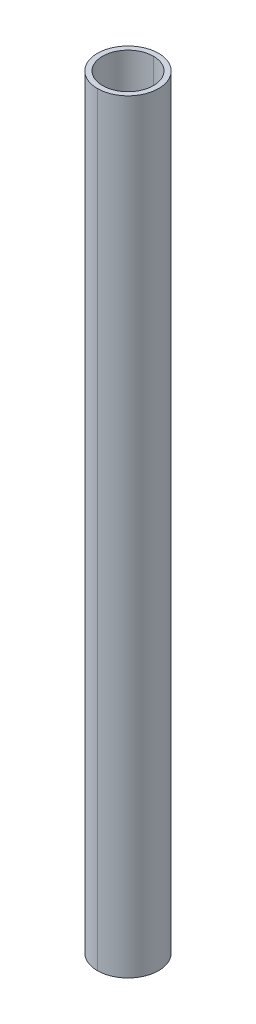
ISO-10303-21;
HEADER;
FILE_DESCRIPTION(('STEP AP214'),'2;1');
FILE_NAME('part.step','',(''),(''),'','','');
FILE_SCHEMA(('AUTOMOTIVE_DESIGN { 1 0 10303 214 1 1 1 1 }'));
ENDSEC;
DATA;
#1=APPLICATION_CONTEXT('core data for automotive mechanical design processes');
#2=APPLICATION_PROTOCOL_DEFINITION('international standard','automotive_design',2000,#1);
#3=PRODUCT_CONTEXT('',#1,'mechanical');
#4=PRODUCT('Part','Part','',(#3));
#5=PRODUCT_RELATED_PRODUCT_CATEGORY('part','',(#4));
#6=PRODUCT_DEFINITION_FORMATION('','',#4);
#7=PRODUCT_DEFINITION_CONTEXT('part definition',#1,'design');
#8=PRODUCT_DEFINITION('design','',#6,#7);
#9=PRODUCT_DEFINITION_SHAPE('','',#8);
#10=(LENGTH_UNIT() NAMED_UNIT(*) SI_UNIT(.MILLI.,.METRE.));
#11=(NAMED_UNIT(*) PLANE_ANGLE_UNIT() SI_UNIT($,.RADIAN.));
#12=(NAMED_UNIT(*) SI_UNIT($,.STERADIAN.) SOLID_ANGLE_UNIT());
#13=UNCERTAINTY_MEASURE_WITH_UNIT(LENGTH_MEASURE(1.E-05),#10,'distance_accuracy_value','');
#14=(GEOMETRIC_REPRESENTATION_CONTEXT(3) GLOBAL_UNCERTAINTY_ASSIGNED_CONTEXT((#13)) GLOBAL_UNIT_ASSIGNED_CONTEXT((#10,
#11,#12)) REPRESENTATION_CONTEXT('',''));
#15=CARTESIAN_POINT('',(0.,0.,0.));
#16=DIRECTION('',(0.,0.,1.));
#17=DIRECTION('',(1.,0.,0.));
#18=AXIS2_PLACEMENT_3D('',#15,#16,#17);
#19=CARTESIAN_POINT('',(0.,150.,0.));
#20=DIRECTION('',(0.,-1.,0.));
#21=DIRECTION('',(0.,0.,-1.));
#22=AXIS2_PLACEMENT_3D('',#19,#20,#21);
#23=CYLINDRICAL_SURFACE('',#22,5.);
#24=DIRECTION('',(0.,-1.,0.));
#25=VECTOR('',#24,1.);
#26=CARTESIAN_POINT('',(0.,150.,5.));
#27=LINE('',#26,#25);
#28=CARTESIAN_POINT('',(0.,150.,5.));
#29=VERTEX_POINT('',#28);
#30=CARTESIAN_POINT('',(0.,0.,5.));
#31=VERTEX_POINT('',#30);
#32=EDGE_CURVE('E95',#29,#31,#27,.T.);
#33=ORIENTED_EDGE('',*,*,#32,.F.);
#34=CARTESIAN_POINT('',(0.,150.,0.));
#35=DIRECTION('',(0.,1.,0.));
#36=DIRECTION('',(0.,0.,1.));
#37=AXIS2_PLACEMENT_3D('',#34,#35,#36);
#38=CIRCLE('',#37,5.);
#39=CARTESIAN_POINT('',(0.,150.,-5.));
#40=VERTEX_POINT('',#39);
#41=EDGE_CURVE('E74',#29,#40,#38,.T.);
#42=ORIENTED_EDGE('',*,*,#41,.T.);
#43=DIRECTION('',(0.,-1.,0.));
#44=VECTOR('',#43,1.);
#45=CARTESIAN_POINT('',(0.,150.,-5.));
#46=LINE('',#45,#44);
#47=CARTESIAN_POINT('',(0.,0.,-5.));
#48=VERTEX_POINT('',#47);
#49=EDGE_CURVE('E83',#40,#48,#46,.T.);
#50=ORIENTED_EDGE('',*,*,#49,.T.);
#51=CARTESIAN_POINT('',(0.,0.,0.));
#52=DIRECTION('',(0.,1.,0.));
#53=DIRECTION('',(0.,0.,1.));
#54=AXIS2_PLACEMENT_3D('',#51,#52,#53);
#55=CIRCLE('',#54,5.);
#56=EDGE_CURVE('E10',#31,#48,#55,.T.);
#57=ORIENTED_EDGE('',*,*,#56,.F.);
#58=EDGE_LOOP('',(#33,#42,#50,#57));
#59=FACE_BOUND('',#58,.T.);
#60=ADVANCED_FACE('F15',(#59),#23,.F.);
#61=CARTESIAN_POINT('',(0.,150.,0.));
#62=DIRECTION('',(0.,-1.,0.));
#63=DIRECTION('',(0.,0.,-1.));
#64=AXIS2_PLACEMENT_3D('',#61,#62,#63);
#65=CYLINDRICAL_SURFACE('',#64,6.);
#66=DIRECTION('',(0.,-1.,0.));
#67=VECTOR('',#66,1.);
#68=CARTESIAN_POINT('',(0.,150.,6.));
#69=LINE('',#68,#67);
#70=CARTESIAN_POINT('',(0.,150.,6.));
#71=VERTEX_POINT('',#70);
#72=CARTESIAN_POINT('',(0.,0.,6.));
#73=VERTEX_POINT('',#72);
#74=EDGE_CURVE('E69',#71,#73,#69,.T.);
#75=ORIENTED_EDGE('',*,*,#74,.F.);
#76=CARTESIAN_POINT('',(0.,150.,0.));
#77=DIRECTION('',(0.,1.,0.));
#78=DIRECTION('',(0.,0.,1.));
#79=AXIS2_PLACEMENT_3D('',#76,#77,#78);
#80=CIRCLE('',#79,6.);
#81=CARTESIAN_POINT('',(0.,150.,-6.));
#82=VERTEX_POINT('',#81);
#83=EDGE_CURVE('E64',#82,#71,#80,.T.);
#84=ORIENTED_EDGE('',*,*,#83,.F.);
#85=DIRECTION('',(0.,-1.,0.));
#86=VECTOR('',#85,1.);
#87=CARTESIAN_POINT('',(0.,150.,-6.));
#88=LINE('',#87,#86);
#89=CARTESIAN_POINT('',(0.,0.,-6.));
#90=VERTEX_POINT('',#89);
#91=EDGE_CURVE('E66',#82,#90,#88,.T.);
#92=ORIENTED_EDGE('',*,*,#91,.T.);
#93=CARTESIAN_POINT('',(0.,0.,0.));
#94=DIRECTION('',(0.,1.,0.));
#95=DIRECTION('',(0.,0.,1.));
#96=AXIS2_PLACEMENT_3D('',#93,#94,#95);
#97=CIRCLE('',#96,6.);
#98=EDGE_CURVE('E26',#90,#73,#97,.T.);
#99=ORIENTED_EDGE('',*,*,#98,.T.);
#100=EDGE_LOOP('',(#75,#84,#92,#99));
#101=FACE_BOUND('',#100,.T.);
#102=ADVANCED_FACE('F17',(#101),#65,.T.);
#103=CARTESIAN_POINT('',(0.,0.,0.));
#104=DIRECTION('',(0.,1.,0.));
#105=DIRECTION('',(1.,0.,0.));
#106=AXIS2_PLACEMENT_3D('',#103,#104,#105);
#107=PLANE('',#106);
#108=CARTESIAN_POINT('',(0.,0.,0.));
#109=DIRECTION('',(0.,1.,0.));
#110=DIRECTION('',(0.,0.,1.));
#111=AXIS2_PLACEMENT_3D('',#108,#109,#110);
#112=CIRCLE('',#111,5.);
#113=EDGE_CURVE('E92',#48,#31,#112,.T.);
#114=ORIENTED_EDGE('',*,*,#113,.T.);
#115=ORIENTED_EDGE('',*,*,#56,.T.);
#116=EDGE_LOOP('',(#114,#115));
#117=FACE_BOUND('',#116,.T.);
#118=ORIENTED_EDGE('',*,*,#98,.F.);
#119=CARTESIAN_POINT('',(0.,0.,0.));
#120=DIRECTION('',(0.,1.,0.));
#121=DIRECTION('',(0.,0.,1.));
#122=AXIS2_PLACEMENT_3D('',#119,#120,#121);
#123=CIRCLE('',#122,6.);
#124=EDGE_CURVE('E78',#73,#90,#123,.T.);
#125=ORIENTED_EDGE('',*,*,#124,.F.);
#126=EDGE_LOOP('',(#118,#125));
#127=FACE_BOUND('',#126,.T.);
#128=ADVANCED_FACE('F129',(#117,#127),#107,.F.);
#129=CARTESIAN_POINT('',(0.,150.,0.));
#130=DIRECTION('',(0.,1.,0.));
#131=DIRECTION('',(1.,0.,0.));
#132=AXIS2_PLACEMENT_3D('',#129,#130,#131);
#133=PLANE('',#132);
#134=CARTESIAN_POINT('',(0.,150.,0.));
#135=DIRECTION('',(0.,1.,0.));
#136=DIRECTION('',(0.,0.,1.));
#137=AXIS2_PLACEMENT_3D('',#134,#135,#136);
#138=CIRCLE('',#137,5.);
#139=EDGE_CURVE('E19',#40,#29,#138,.T.);
#140=ORIENTED_EDGE('',*,*,#139,.F.);
#141=ORIENTED_EDGE('',*,*,#41,.F.);
#142=EDGE_LOOP('',(#140,#141));
#143=FACE_BOUND('',#142,.T.);
#144=ORIENTED_EDGE('',*,*,#83,.T.);
#145=CARTESIAN_POINT('',(0.,150.,0.));
#146=DIRECTION('',(0.,1.,0.));
#147=DIRECTION('',(0.,0.,1.));
#148=AXIS2_PLACEMENT_3D('',#145,#146,#147);
#149=CIRCLE('',#148,6.);
#150=EDGE_CURVE('E77',#71,#82,#149,.T.);
#151=ORIENTED_EDGE('',*,*,#150,.T.);
#152=EDGE_LOOP('',(#144,#151));
#153=FACE_BOUND('',#152,.T.);
#154=ADVANCED_FACE('F81',(#143,#153),#133,.T.);
#155=CARTESIAN_POINT('',(0.,150.,0.));
#156=DIRECTION('',(0.,-1.,0.));
#157=DIRECTION('',(0.,0.,-1.));
#158=AXIS2_PLACEMENT_3D('',#155,#156,#157);
#159=CYLINDRICAL_SURFACE('',#158,6.);
#160=ORIENTED_EDGE('',*,*,#150,.F.);
#161=ORIENTED_EDGE('',*,*,#74,.T.);
#162=ORIENTED_EDGE('',*,*,#124,.T.);
#163=ORIENTED_EDGE('',*,*,#91,.F.);
#164=EDGE_LOOP('',(#160,#161,#162,#163));
#165=FACE_BOUND('',#164,.T.);
#166=ADVANCED_FACE('F76',(#165),#159,.T.);
#167=CARTESIAN_POINT('',(0.,150.,0.));
#168=DIRECTION('',(0.,-1.,0.));
#169=DIRECTION('',(0.,0.,-1.));
#170=AXIS2_PLACEMENT_3D('',#167,#168,#169);
#171=CYLINDRICAL_SURFACE('',#170,5.);
#172=ORIENTED_EDGE('',*,*,#139,.T.);
#173=ORIENTED_EDGE('',*,*,#32,.T.);
#174=ORIENTED_EDGE('',*,*,#113,.F.);
#175=ORIENTED_EDGE('',*,*,#49,.F.);
#176=EDGE_LOOP('',(#172,#173,#174,#175));
#177=FACE_BOUND('',#176,.T.);
#178=ADVANCED_FACE('F165',(#177),#171,.F.);
#179=CLOSED_SHELL('',(#60,#102,#128,#154,#166,#178));
#180=MANIFOLD_SOLID_BREP('B1',#179);
#181=ADVANCED_BREP_SHAPE_REPRESENTATION('',(#18,#180),#14);
#182=SHAPE_DEFINITION_REPRESENTATION(#9,#181);
ENDSEC;
END-ISO-10303-21;
